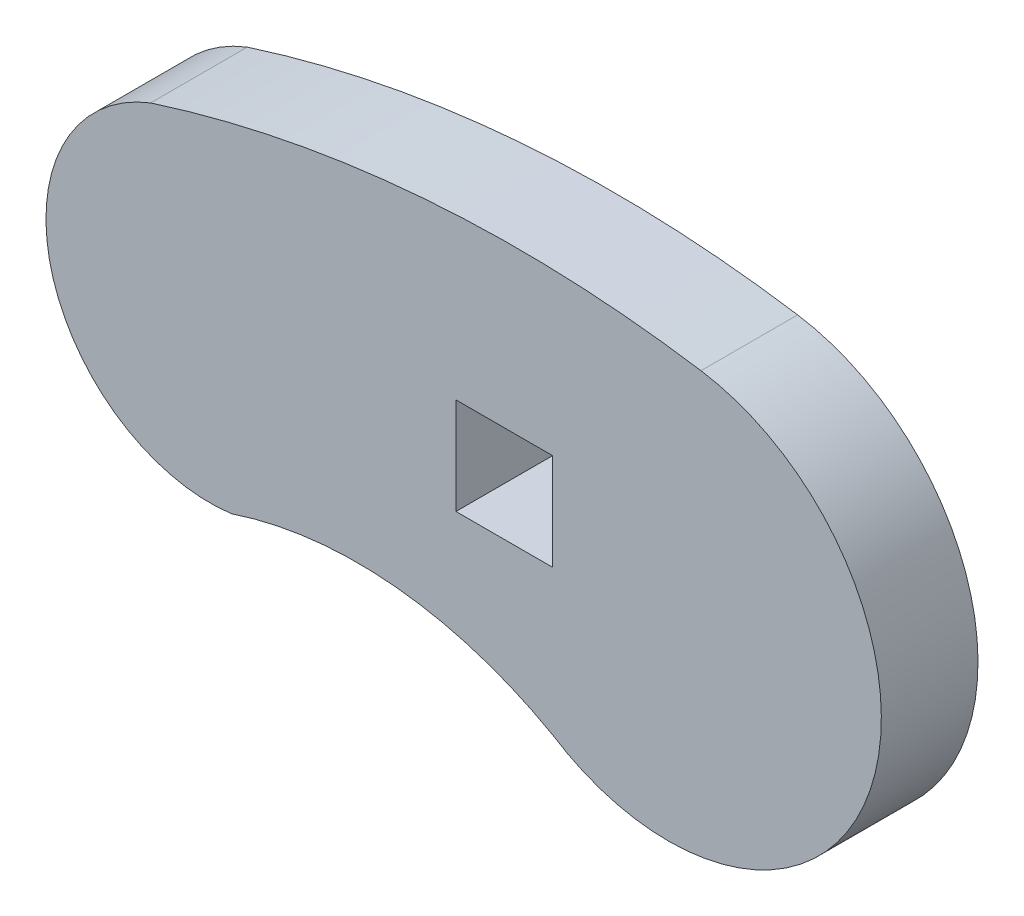
ISO-10303-21;
HEADER;
FILE_DESCRIPTION(('STEP AP214'),'2;1');
FILE_NAME('part.step','',(''),(''),'','','');
FILE_SCHEMA(('AUTOMOTIVE_DESIGN { 1 0 10303 214 1 1 1 1 }'));
ENDSEC;
DATA;
#1=APPLICATION_CONTEXT('core data for automotive mechanical design processes');
#2=APPLICATION_PROTOCOL_DEFINITION('international standard','automotive_design',2000,#1);
#3=PRODUCT_CONTEXT('',#1,'mechanical');
#4=PRODUCT('Part','Part','',(#3));
#5=PRODUCT_RELATED_PRODUCT_CATEGORY('part','',(#4));
#6=PRODUCT_DEFINITION_FORMATION('','',#4);
#7=PRODUCT_DEFINITION_CONTEXT('part definition',#1,'design');
#8=PRODUCT_DEFINITION('design','',#6,#7);
#9=PRODUCT_DEFINITION_SHAPE('','',#8);
#10=(LENGTH_UNIT() NAMED_UNIT(*) SI_UNIT(.MILLI.,.METRE.));
#11=(NAMED_UNIT(*) PLANE_ANGLE_UNIT() SI_UNIT($,.RADIAN.));
#12=(NAMED_UNIT(*) SI_UNIT($,.STERADIAN.) SOLID_ANGLE_UNIT());
#13=UNCERTAINTY_MEASURE_WITH_UNIT(LENGTH_MEASURE(1.E-05),#10,'distance_accuracy_value','');
#14=(GEOMETRIC_REPRESENTATION_CONTEXT(3) GLOBAL_UNCERTAINTY_ASSIGNED_CONTEXT((#13)) GLOBAL_UNIT_ASSIGNED_CONTEXT((#10,
#11,#12)) REPRESENTATION_CONTEXT('',''));
#15=CARTESIAN_POINT('',(0.,0.,0.));
#16=DIRECTION('',(0.,0.,1.));
#17=DIRECTION('',(1.,0.,0.));
#18=AXIS2_PLACEMENT_3D('',#15,#16,#17);
#19=CARTESIAN_POINT('',(0.897120910067132,-5.11261429948937,1.524));
#20=DIRECTION('',(0.,0.,-1.));
#21=DIRECTION('',(-1.,0.,0.));
#22=AXIS2_PLACEMENT_3D('',#19,#20,#21);
#23=PLANE('',#22);
#24=CARTESIAN_POINT('',(-1.55268325445669,-9.23548645017222,1.524));
#25=DIRECTION('',(0.,0.,-1.));
#26=DIRECTION('',(-1.,0.,0.));
#27=AXIS2_PLACEMENT_3D('',#24,#25,#26);
#28=CIRCLE('',#27,6.23570931606092);
#29=CARTESIAN_POINT('',(-3.53582046420034,-3.32352928847532,1.524));
#30=VERTEX_POINT('',#29);
#31=CARTESIAN_POINT('',(1.52400000000007,-3.81164179659352,1.524));
#32=VERTEX_POINT('',#31);
#33=EDGE_CURVE('E133',#30,#32,#28,.T.);
#34=ORIENTED_EDGE('',*,*,#33,.T.);
#35=CARTESIAN_POINT('',(3.34692507459096,-0.989742148806527,1.524));
#36=DIRECTION('',(0.,0.,1.));
#37=DIRECTION('',(1.,0.,0.));
#38=AXIS2_PLACEMENT_3D('',#35,#36,#37);
#39=CIRCLE('',#38,3.35949005799281);
#40=CARTESIAN_POINT('',(3.86325292993898,2.329832973938,1.524));
#41=VERTEX_POINT('',#40);
#42=EDGE_CURVE('E136',#32,#41,#39,.T.);
#43=ORIENTED_EDGE('',*,*,#42,.T.);
#44=CARTESIAN_POINT('',(0.964246102665219,-16.308462141862,1.524));
#45=DIRECTION('',(0.,0.,1.));
#46=DIRECTION('',(-1.,0.,0.));
#47=AXIS2_PLACEMENT_3D('',#44,#45,#46);
#48=CIRCLE('',#47,18.8624040198548);
#49=CARTESIAN_POINT('',(-4.81301827092692,1.64741438271505,1.524));
#50=VERTEX_POINT('',#49);
#51=EDGE_CURVE('E139',#41,#50,#48,.T.);
#52=ORIENTED_EDGE('',*,*,#51,.T.);
#53=CARTESIAN_POINT('',(-3.8783984129001,-0.762,1.524));
#54=DIRECTION('',(0.,0.,1.));
#55=DIRECTION('',(1.,0.,0.));
#56=AXIS2_PLACEMENT_3D('',#53,#54,#55);
#57=CIRCLE('',#56,2.58433588116023);
#58=EDGE_CURVE('E141',#50,#30,#57,.T.);
#59=ORIENTED_EDGE('',*,*,#58,.T.);
#60=EDGE_LOOP('',(#34,#43,#52,#59));
#61=FACE_BOUND('',#60,.T.);
#62=DIRECTION('',(0.,-1.,0.));
#63=VECTOR('',#62,1.);
#64=CARTESIAN_POINT('',(0.,-1.52399999999998,1.524));
#65=LINE('',#64,#63);
#66=CARTESIAN_POINT('',(0.,0.,1.524));
#67=VERTEX_POINT('',#66);
#68=CARTESIAN_POINT('',(0.,-1.52399999999998,1.524));
#69=VERTEX_POINT('',#68);
#70=EDGE_CURVE('E97',#67,#69,#65,.T.);
#71=ORIENTED_EDGE('',*,*,#70,.F.);
#72=DIRECTION('',(-1.,0.,0.));
#73=VECTOR('',#72,1.);
#74=CARTESIAN_POINT('',(0.,0.,1.524));
#75=LINE('',#74,#73);
#76=CARTESIAN_POINT('',(1.52399999999983,0.,1.524));
#77=VERTEX_POINT('',#76);
#78=EDGE_CURVE('E119',#77,#67,#75,.T.);
#79=ORIENTED_EDGE('',*,*,#78,.F.);
#80=DIRECTION('',(0.,1.,0.));
#81=VECTOR('',#80,1.);
#82=CARTESIAN_POINT('',(1.52399999999983,0.,1.524));
#83=LINE('',#82,#81);
#84=CARTESIAN_POINT('',(1.52399999999983,-1.524,1.524));
#85=VERTEX_POINT('',#84);
#86=EDGE_CURVE('E117',#85,#77,#83,.T.);
#87=ORIENTED_EDGE('',*,*,#86,.F.);
#88=DIRECTION('',(1.,0.,0.));
#89=VECTOR('',#88,1.);
#90=CARTESIAN_POINT('',(1.52399999999983,-1.524,1.524));
#91=LINE('',#90,#89);
#92=EDGE_CURVE('E105',#69,#85,#91,.T.);
#93=ORIENTED_EDGE('',*,*,#92,.F.);
#94=EDGE_LOOP('',(#71,#79,#87,#93));
#95=FACE_BOUND('',#94,.T.);
#96=ADVANCED_FACE('F32',(#61,#95),#23,.F.);
#97=CARTESIAN_POINT('',(0.897120910067132,-5.11261429948937,0.));
#98=DIRECTION('',(0.,0.,-1.));
#99=DIRECTION('',(-1.,0.,0.));
#100=AXIS2_PLACEMENT_3D('',#97,#98,#99);
#101=PLANE('',#100);
#102=CARTESIAN_POINT('',(-1.55268325445669,-9.23548645017222,0.));
#103=DIRECTION('',(0.,0.,-1.));
#104=DIRECTION('',(-1.,0.,0.));
#105=AXIS2_PLACEMENT_3D('',#102,#103,#104);
#106=CIRCLE('',#105,6.23570931606092);
#107=CARTESIAN_POINT('',(-3.53582046420034,-3.32352928847532,0.));
#108=VERTEX_POINT('',#107);
#109=CARTESIAN_POINT('',(1.52400000000007,-3.81164179659352,0.));
#110=VERTEX_POINT('',#109);
#111=EDGE_CURVE('E113',#108,#110,#106,.T.);
#112=ORIENTED_EDGE('',*,*,#111,.F.);
#113=CARTESIAN_POINT('',(-3.8783984129001,-0.762,0.));
#114=DIRECTION('',(0.,0.,1.));
#115=DIRECTION('',(1.,0.,0.));
#116=AXIS2_PLACEMENT_3D('',#113,#114,#115);
#117=CIRCLE('',#116,2.58433588116023);
#118=CARTESIAN_POINT('',(-4.81301827092692,1.64741438271505,0.));
#119=VERTEX_POINT('',#118);
#120=EDGE_CURVE('E137',#119,#108,#117,.T.);
#121=ORIENTED_EDGE('',*,*,#120,.F.);
#122=CARTESIAN_POINT('',(0.964246102665219,-16.308462141862,0.));
#123=DIRECTION('',(0.,0.,1.));
#124=DIRECTION('',(-1.,0.,0.));
#125=AXIS2_PLACEMENT_3D('',#122,#123,#124);
#126=CIRCLE('',#125,18.8624040198548);
#127=CARTESIAN_POINT('',(3.86325292993898,2.329832973938,0.));
#128=VERTEX_POINT('',#127);
#129=EDGE_CURVE('E148',#128,#119,#126,.T.);
#130=ORIENTED_EDGE('',*,*,#129,.F.);
#131=CARTESIAN_POINT('',(3.34692507459096,-0.989742148806527,0.));
#132=DIRECTION('',(0.,0.,1.));
#133=DIRECTION('',(1.,0.,0.));
#134=AXIS2_PLACEMENT_3D('',#131,#132,#133);
#135=CIRCLE('',#134,3.35949005799281);
#136=EDGE_CURVE('E146',#110,#128,#135,.T.);
#137=ORIENTED_EDGE('',*,*,#136,.F.);
#138=EDGE_LOOP('',(#112,#121,#130,#137));
#139=FACE_BOUND('',#138,.T.);
#140=DIRECTION('',(-1.,0.,0.));
#141=VECTOR('',#140,1.);
#142=CARTESIAN_POINT('',(0.,0.,0.));
#143=LINE('',#142,#141);
#144=CARTESIAN_POINT('',(1.52399999999983,0.,0.));
#145=VERTEX_POINT('',#144);
#146=CARTESIAN_POINT('',(0.,0.,0.));
#147=VERTEX_POINT('',#146);
#148=EDGE_CURVE('E106',#145,#147,#143,.T.);
#149=ORIENTED_EDGE('',*,*,#148,.T.);
#150=DIRECTION('',(0.,-1.,0.));
#151=VECTOR('',#150,1.);
#152=CARTESIAN_POINT('',(0.,-1.52399999999998,0.));
#153=LINE('',#152,#151);
#154=CARTESIAN_POINT('',(0.,-1.52399999999998,0.));
#155=VERTEX_POINT('',#154);
#156=EDGE_CURVE('E55',#147,#155,#153,.T.);
#157=ORIENTED_EDGE('',*,*,#156,.T.);
#158=DIRECTION('',(1.,0.,0.));
#159=VECTOR('',#158,1.);
#160=CARTESIAN_POINT('',(1.52399999999983,-1.524,0.));
#161=LINE('',#160,#159);
#162=CARTESIAN_POINT('',(1.52399999999983,-1.524,0.));
#163=VERTEX_POINT('',#162);
#164=EDGE_CURVE('E112',#155,#163,#161,.T.);
#165=ORIENTED_EDGE('',*,*,#164,.T.);
#166=DIRECTION('',(0.,1.,0.));
#167=VECTOR('',#166,1.);
#168=CARTESIAN_POINT('',(1.52399999999983,0.,0.));
#169=LINE('',#168,#167);
#170=EDGE_CURVE('E125',#163,#145,#169,.T.);
#171=ORIENTED_EDGE('',*,*,#170,.T.);
#172=EDGE_LOOP('',(#149,#157,#165,#171));
#173=FACE_BOUND('',#172,.T.);
#174=ADVANCED_FACE('F166',(#139,#173),#101,.T.);
#175=CARTESIAN_POINT('',(-1.55268325445669,-9.23548645017222,1.524));
#176=DIRECTION('',(0.,0.,-1.));
#177=DIRECTION('',(-1.,0.,0.));
#178=AXIS2_PLACEMENT_3D('',#175,#176,#177);
#179=CYLINDRICAL_SURFACE('',#178,6.23570931606092);
#180=ORIENTED_EDGE('',*,*,#111,.T.);
#181=DIRECTION('',(0.,0.,-1.));
#182=VECTOR('',#181,1.);
#183=CARTESIAN_POINT('',(1.52400000000007,-3.81164179659352,1.524));
#184=LINE('',#183,#182);
#185=EDGE_CURVE('E11',#32,#110,#184,.T.);
#186=ORIENTED_EDGE('',*,*,#185,.F.);
#187=ORIENTED_EDGE('',*,*,#33,.F.);
#188=DIRECTION('',(0.,0.,-1.));
#189=VECTOR('',#188,1.);
#190=CARTESIAN_POINT('',(-3.53582046420034,-3.32352928847532,1.524));
#191=LINE('',#190,#189);
#192=EDGE_CURVE('E143',#30,#108,#191,.T.);
#193=ORIENTED_EDGE('',*,*,#192,.T.);
#194=EDGE_LOOP('',(#180,#186,#187,#193));
#195=FACE_BOUND('',#194,.T.);
#196=ADVANCED_FACE('F34',(#195),#179,.F.);
#197=CARTESIAN_POINT('',(3.34692507459096,-0.989742148806527,1.524));
#198=DIRECTION('',(0.,0.,-1.));
#199=DIRECTION('',(-1.,0.,0.));
#200=AXIS2_PLACEMENT_3D('',#197,#198,#199);
#201=CYLINDRICAL_SURFACE('',#200,3.35949005799281);
#202=ORIENTED_EDGE('',*,*,#136,.T.);
#203=DIRECTION('',(0.,0.,-1.));
#204=VECTOR('',#203,1.);
#205=CARTESIAN_POINT('',(3.86325292993898,2.329832973938,1.524));
#206=LINE('',#205,#204);
#207=EDGE_CURVE('E40',#41,#128,#206,.T.);
#208=ORIENTED_EDGE('',*,*,#207,.F.);
#209=ORIENTED_EDGE('',*,*,#42,.F.);
#210=ORIENTED_EDGE('',*,*,#185,.T.);
#211=EDGE_LOOP('',(#202,#208,#209,#210));
#212=FACE_BOUND('',#211,.T.);
#213=ADVANCED_FACE('F176',(#212),#201,.T.);
#214=CARTESIAN_POINT('',(0.964246102665219,-16.308462141862,1.524));
#215=DIRECTION('',(0.,0.,-1.));
#216=DIRECTION('',(-1.,0.,0.));
#217=AXIS2_PLACEMENT_3D('',#214,#215,#216);
#218=CYLINDRICAL_SURFACE('',#217,18.8624040198548);
#219=ORIENTED_EDGE('',*,*,#129,.T.);
#220=DIRECTION('',(0.,0.,-1.));
#221=VECTOR('',#220,1.);
#222=CARTESIAN_POINT('',(-4.81301827092692,1.64741438271505,1.524));
#223=LINE('',#222,#221);
#224=EDGE_CURVE('E153',#50,#119,#223,.T.);
#225=ORIENTED_EDGE('',*,*,#224,.F.);
#226=ORIENTED_EDGE('',*,*,#51,.F.);
#227=ORIENTED_EDGE('',*,*,#207,.T.);
#228=EDGE_LOOP('',(#219,#225,#226,#227));
#229=FACE_BOUND('',#228,.T.);
#230=ADVANCED_FACE('F160',(#229),#218,.T.);
#231=CARTESIAN_POINT('',(-3.8783984129001,-0.762,1.524));
#232=DIRECTION('',(0.,0.,-1.));
#233=DIRECTION('',(-1.,0.,0.));
#234=AXIS2_PLACEMENT_3D('',#231,#232,#233);
#235=CYLINDRICAL_SURFACE('',#234,2.58433588116023);
#236=ORIENTED_EDGE('',*,*,#120,.T.);
#237=ORIENTED_EDGE('',*,*,#192,.F.);
#238=ORIENTED_EDGE('',*,*,#58,.F.);
#239=ORIENTED_EDGE('',*,*,#224,.T.);
#240=EDGE_LOOP('',(#236,#237,#238,#239));
#241=FACE_BOUND('',#240,.T.);
#242=ADVANCED_FACE('F170',(#241),#235,.T.);
#243=CARTESIAN_POINT('',(0.,-1.52399999999998,1.524));
#244=DIRECTION('',(1.,0.,0.));
#245=DIRECTION('',(0.,1.,0.));
#246=AXIS2_PLACEMENT_3D('',#243,#244,#245);
#247=PLANE('',#246);
#248=ORIENTED_EDGE('',*,*,#156,.F.);
#249=DIRECTION('',(0.,0.,-1.));
#250=VECTOR('',#249,1.);
#251=CARTESIAN_POINT('',(0.,0.,1.524));
#252=LINE('',#251,#250);
#253=EDGE_CURVE('E101',#67,#147,#252,.T.);
#254=ORIENTED_EDGE('',*,*,#253,.F.);
#255=ORIENTED_EDGE('',*,*,#70,.T.);
#256=DIRECTION('',(0.,0.,-1.));
#257=VECTOR('',#256,1.);
#258=CARTESIAN_POINT('',(0.,-1.52399999999998,1.524));
#259=LINE('',#258,#257);
#260=EDGE_CURVE('E100',#69,#155,#259,.T.);
#261=ORIENTED_EDGE('',*,*,#260,.T.);
#262=EDGE_LOOP('',(#248,#254,#255,#261));
#263=FACE_BOUND('',#262,.T.);
#264=ADVANCED_FACE('F99',(#263),#247,.T.);
#265=CARTESIAN_POINT('',(1.52399999999983,-1.524,1.524));
#266=DIRECTION('',(0.,1.,0.));
#267=DIRECTION('',(-1.,0.,0.));
#268=AXIS2_PLACEMENT_3D('',#265,#266,#267);
#269=PLANE('',#268);
#270=ORIENTED_EDGE('',*,*,#164,.F.);
#271=ORIENTED_EDGE('',*,*,#260,.F.);
#272=ORIENTED_EDGE('',*,*,#92,.T.);
#273=DIRECTION('',(0.,0.,-1.));
#274=VECTOR('',#273,1.);
#275=CARTESIAN_POINT('',(1.52399999999983,-1.524,1.524));
#276=LINE('',#275,#274);
#277=EDGE_CURVE('E114',#85,#163,#276,.T.);
#278=ORIENTED_EDGE('',*,*,#277,.T.);
#279=EDGE_LOOP('',(#270,#271,#272,#278));
#280=FACE_BOUND('',#279,.T.);
#281=ADVANCED_FACE('F109',(#280),#269,.T.);
#282=CARTESIAN_POINT('',(1.52399999999983,0.,1.524));
#283=DIRECTION('',(-1.,0.,0.));
#284=DIRECTION('',(0.,-1.,0.));
#285=AXIS2_PLACEMENT_3D('',#282,#283,#284);
#286=PLANE('',#285);
#287=ORIENTED_EDGE('',*,*,#170,.F.);
#288=ORIENTED_EDGE('',*,*,#277,.F.);
#289=ORIENTED_EDGE('',*,*,#86,.T.);
#290=DIRECTION('',(0.,0.,-1.));
#291=VECTOR('',#290,1.);
#292=CARTESIAN_POINT('',(1.52399999999983,0.,1.524));
#293=LINE('',#292,#291);
#294=EDGE_CURVE('E47',#77,#145,#293,.T.);
#295=ORIENTED_EDGE('',*,*,#294,.T.);
#296=EDGE_LOOP('',(#287,#288,#289,#295));
#297=FACE_BOUND('',#296,.T.);
#298=ADVANCED_FACE('F199',(#297),#286,.T.);
#299=CARTESIAN_POINT('',(0.,0.,1.524));
#300=DIRECTION('',(0.,-1.,0.));
#301=DIRECTION('',(1.,0.,0.));
#302=AXIS2_PLACEMENT_3D('',#299,#300,#301);
#303=PLANE('',#302);
#304=ORIENTED_EDGE('',*,*,#148,.F.);
#305=ORIENTED_EDGE('',*,*,#294,.F.);
#306=ORIENTED_EDGE('',*,*,#78,.T.);
#307=ORIENTED_EDGE('',*,*,#253,.T.);
#308=EDGE_LOOP('',(#304,#305,#306,#307));
#309=FACE_BOUND('',#308,.T.);
#310=ADVANCED_FACE('F203',(#309),#303,.T.);
#311=CLOSED_SHELL('',(#96,#174,#196,#213,#230,#242,#264,#281,#298,#310));
#312=MANIFOLD_SOLID_BREP('B2',#311);
#313=ADVANCED_BREP_SHAPE_REPRESENTATION('',(#18,#312),#14);
#314=SHAPE_DEFINITION_REPRESENTATION(#9,#313);
ENDSEC;
END-ISO-10303-21;
